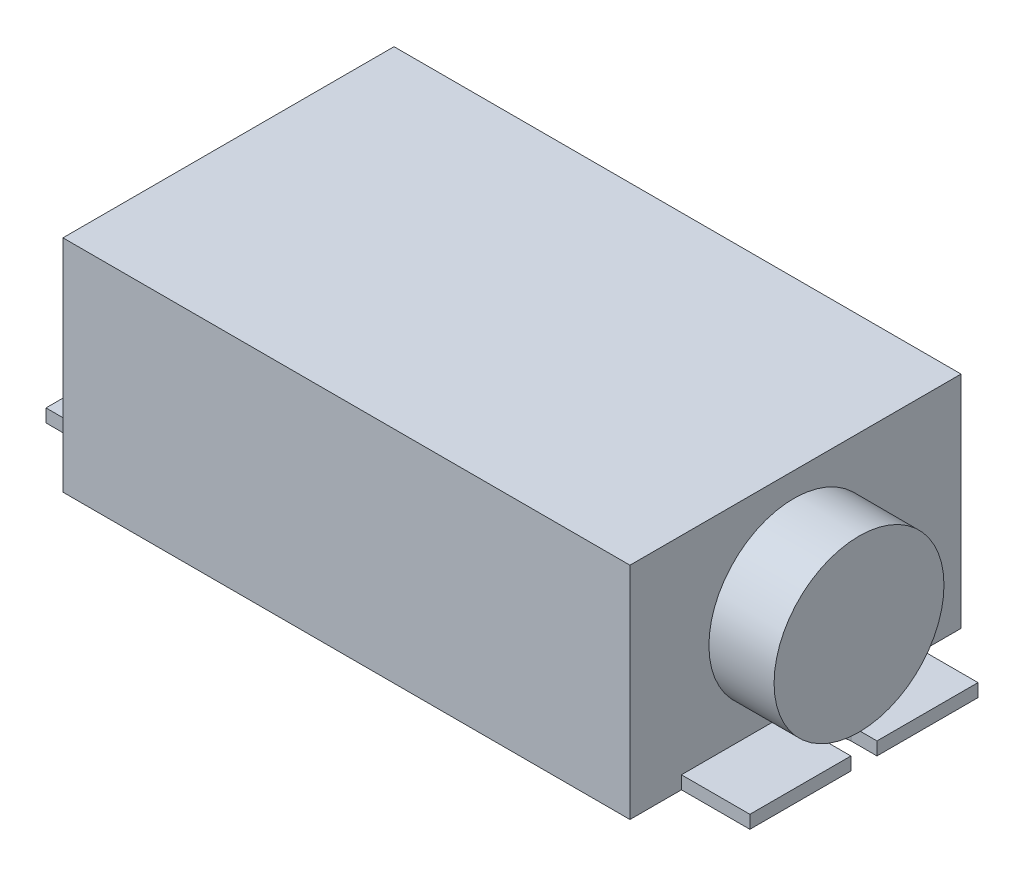
ISO-10303-21;
HEADER;
FILE_DESCRIPTION(('STEP AP214'),'2;1');
FILE_NAME('part.step','',(''),(''),'','','');
FILE_SCHEMA(('AUTOMOTIVE_DESIGN { 1 0 10303 214 1 1 1 1 }'));
ENDSEC;
DATA;
#1=APPLICATION_CONTEXT('core data for automotive mechanical design processes');
#2=APPLICATION_PROTOCOL_DEFINITION('international standard','automotive_design',2000,#1);
#3=PRODUCT_CONTEXT('',#1,'mechanical');
#4=PRODUCT('Part','Part','',(#3));
#5=PRODUCT_RELATED_PRODUCT_CATEGORY('part','',(#4));
#6=PRODUCT_DEFINITION_FORMATION('','',#4);
#7=PRODUCT_DEFINITION_CONTEXT('part definition',#1,'design');
#8=PRODUCT_DEFINITION('design','',#6,#7);
#9=PRODUCT_DEFINITION_SHAPE('','',#8);
#10=(LENGTH_UNIT() NAMED_UNIT(*) SI_UNIT(.MILLI.,.METRE.));
#11=(NAMED_UNIT(*) PLANE_ANGLE_UNIT() SI_UNIT($,.RADIAN.));
#12=(NAMED_UNIT(*) SI_UNIT($,.STERADIAN.) SOLID_ANGLE_UNIT());
#13=UNCERTAINTY_MEASURE_WITH_UNIT(LENGTH_MEASURE(1.E-05),#10,'distance_accuracy_value','');
#14=(GEOMETRIC_REPRESENTATION_CONTEXT(3) GLOBAL_UNCERTAINTY_ASSIGNED_CONTEXT((#13)) GLOBAL_UNIT_ASSIGNED_CONTEXT((#10,
#11,#12)) REPRESENTATION_CONTEXT('',''));
#15=CARTESIAN_POINT('',(0.,0.,0.));
#16=DIRECTION('',(0.,0.,1.));
#17=DIRECTION('',(1.,0.,0.));
#18=AXIS2_PLACEMENT_3D('',#15,#16,#17);
#19=CARTESIAN_POINT('',(0.,33.8,0.));
#20=DIRECTION('',(1.,0.,0.));
#21=DIRECTION('',(0.,0.,-1.));
#22=AXIS2_PLACEMENT_3D('',#19,#20,#21);
#23=PLANE('',#22);
#24=DIRECTION('',(0.,-1.,0.));
#25=VECTOR('',#24,1.);
#26=CARTESIAN_POINT('',(0.,2.,-42.9));
#27=LINE('',#26,#25);
#28=CARTESIAN_POINT('',(0.,2.,-42.9));
#29=VERTEX_POINT('',#28);
#30=CARTESIAN_POINT('',(0.,0.,-42.9));
#31=VERTEX_POINT('',#30);
#32=EDGE_CURVE('E195',#29,#31,#27,.T.);
#33=ORIENTED_EDGE('',*,*,#32,.F.);
#34=DIRECTION('',(0.,0.,1.));
#35=VECTOR('',#34,1.);
#36=CARTESIAN_POINT('',(0.,2.,-42.9));
#37=LINE('',#36,#35);
#38=CARTESIAN_POINT('',(0.,2.,-7.9));
#39=VERTEX_POINT('',#38);
#40=EDGE_CURVE('E187',#29,#39,#37,.T.);
#41=ORIENTED_EDGE('',*,*,#40,.T.);
#42=DIRECTION('',(0.,-1.,0.));
#43=VECTOR('',#42,1.);
#44=CARTESIAN_POINT('',(0.,2.,-7.9));
#45=LINE('',#44,#43);
#46=CARTESIAN_POINT('',(0.,0.,-7.9));
#47=VERTEX_POINT('',#46);
#48=EDGE_CURVE('E173',#39,#47,#45,.T.);
#49=ORIENTED_EDGE('',*,*,#48,.T.);
#50=DIRECTION('',(0.,0.,1.));
#51=VECTOR('',#50,1.);
#52=CARTESIAN_POINT('',(0.,0.,0.));
#53=LINE('',#52,#51);
#54=CARTESIAN_POINT('',(0.,0.,0.));
#55=VERTEX_POINT('',#54);
#56=EDGE_CURVE('E235',#47,#55,#53,.T.);
#57=ORIENTED_EDGE('',*,*,#56,.T.);
#58=DIRECTION('',(0.,-1.,0.));
#59=VECTOR('',#58,1.);
#60=CARTESIAN_POINT('',(0.,33.8,0.));
#61=LINE('',#60,#59);
#62=CARTESIAN_POINT('',(0.,33.8,0.));
#63=VERTEX_POINT('',#62);
#64=EDGE_CURVE('E46',#63,#55,#61,.T.);
#65=ORIENTED_EDGE('',*,*,#64,.F.);
#66=DIRECTION('',(0.,0.,1.));
#67=VECTOR('',#66,1.);
#68=CARTESIAN_POINT('',(0.,33.8,0.));
#69=LINE('',#68,#67);
#70=CARTESIAN_POINT('',(0.,33.8,-50.8));
#71=VERTEX_POINT('',#70);
#72=EDGE_CURVE('E305',#71,#63,#69,.T.);
#73=ORIENTED_EDGE('',*,*,#72,.F.);
#74=DIRECTION('',(0.,-1.,0.));
#75=VECTOR('',#74,1.);
#76=CARTESIAN_POINT('',(0.,33.8,-50.8));
#77=LINE('',#76,#75);
#78=CARTESIAN_POINT('',(0.,0.,-50.8));
#79=VERTEX_POINT('',#78);
#80=EDGE_CURVE('E315',#71,#79,#77,.T.);
#81=ORIENTED_EDGE('',*,*,#80,.T.);
#82=EDGE_CURVE('E316',#79,#31,#53,.T.);
#83=ORIENTED_EDGE('',*,*,#82,.T.);
#84=EDGE_LOOP('',(#33,#41,#49,#57,#65,#73,#81,#83));
#85=FACE_BOUND('',#84,.T.);
#86=ADVANCED_FACE('F39',(#85),#23,.F.);
#87=CARTESIAN_POINT('',(87.,33.8,0.));
#88=DIRECTION('',(-1.,0.,0.));
#89=DIRECTION('',(0.,0.,1.));
#90=AXIS2_PLACEMENT_3D('',#87,#88,#89);
#91=PLANE('',#90);
#92=CARTESIAN_POINT('',(87.,17.068762313408,-25.1463572331028));
#93=DIRECTION('',(-1.,0.,0.));
#94=DIRECTION('',(0.,0.,1.));
#95=AXIS2_PLACEMENT_3D('',#92,#93,#94);
#96=CIRCLE('',#95,13.0342339037933);
#97=CARTESIAN_POINT('',(87.,17.068762313408,-12.1121233293095));
#98=VERTEX_POINT('',#97);
#99=EDGE_CURVE('E11',#98,#98,#96,.F.);
#100=ORIENTED_EDGE('',*,*,#99,.F.);
#101=EDGE_LOOP('',(#100));
#102=FACE_BOUND('',#101,.T.);
#103=DIRECTION('',(0.,-1.,0.));
#104=VECTOR('',#103,1.);
#105=CARTESIAN_POINT('',(87.,2.,-7.90000000000005));
#106=LINE('',#105,#104);
#107=CARTESIAN_POINT('',(87.,2.,-7.90000000000005));
#108=VERTEX_POINT('',#107);
#109=CARTESIAN_POINT('',(87.,0.,-7.90000000000005));
#110=VERTEX_POINT('',#109);
#111=EDGE_CURVE('E254',#108,#110,#106,.T.);
#112=ORIENTED_EDGE('',*,*,#111,.F.);
#113=DIRECTION('',(0.,0.,-1.));
#114=VECTOR('',#113,1.);
#115=CARTESIAN_POINT('',(87.,2.,-42.9));
#116=LINE('',#115,#114);
#117=CARTESIAN_POINT('',(87.,2.,-42.9));
#118=VERTEX_POINT('',#117);
#119=EDGE_CURVE('E291',#108,#118,#116,.T.);
#120=ORIENTED_EDGE('',*,*,#119,.T.);
#121=DIRECTION('',(0.,-1.,0.));
#122=VECTOR('',#121,1.);
#123=CARTESIAN_POINT('',(87.,2.,-42.9));
#124=LINE('',#123,#122);
#125=CARTESIAN_POINT('',(87.,0.,-42.9));
#126=VERTEX_POINT('',#125);
#127=EDGE_CURVE('E256',#118,#126,#124,.T.);
#128=ORIENTED_EDGE('',*,*,#127,.T.);
#129=DIRECTION('',(0.,0.,-1.));
#130=VECTOR('',#129,1.);
#131=CARTESIAN_POINT('',(87.,0.,0.));
#132=LINE('',#131,#130);
#133=CARTESIAN_POINT('',(87.,0.,-50.8));
#134=VERTEX_POINT('',#133);
#135=EDGE_CURVE('E320',#126,#134,#132,.T.);
#136=ORIENTED_EDGE('',*,*,#135,.T.);
#137=DIRECTION('',(0.,-1.,0.));
#138=VECTOR('',#137,1.);
#139=CARTESIAN_POINT('',(87.,33.8,-50.8));
#140=LINE('',#139,#138);
#141=CARTESIAN_POINT('',(87.,33.8,-50.8));
#142=VERTEX_POINT('',#141);
#143=EDGE_CURVE('E327',#142,#134,#140,.T.);
#144=ORIENTED_EDGE('',*,*,#143,.F.);
#145=DIRECTION('',(0.,0.,-1.));
#146=VECTOR('',#145,1.);
#147=CARTESIAN_POINT('',(87.,33.8,0.));
#148=LINE('',#147,#146);
#149=CARTESIAN_POINT('',(87.,33.8,0.));
#150=VERTEX_POINT('',#149);
#151=EDGE_CURVE('E311',#150,#142,#148,.T.);
#152=ORIENTED_EDGE('',*,*,#151,.F.);
#153=DIRECTION('',(0.,-1.,0.));
#154=VECTOR('',#153,1.);
#155=CARTESIAN_POINT('',(87.,33.8,0.));
#156=LINE('',#155,#154);
#157=CARTESIAN_POINT('',(87.,0.,0.));
#158=VERTEX_POINT('',#157);
#159=EDGE_CURVE('E330',#150,#158,#156,.T.);
#160=ORIENTED_EDGE('',*,*,#159,.T.);
#161=EDGE_CURVE('E321',#158,#110,#132,.T.);
#162=ORIENTED_EDGE('',*,*,#161,.T.);
#163=EDGE_LOOP('',(#112,#120,#128,#136,#144,#152,#160,#162));
#164=FACE_BOUND('',#163,.T.);
#165=ADVANCED_FACE('F346',(#102,#164),#91,.F.);
#166=CARTESIAN_POINT('',(0.,33.8,0.));
#167=DIRECTION('',(0.,0.,-1.));
#168=DIRECTION('',(-1.,0.,0.));
#169=AXIS2_PLACEMENT_3D('',#166,#167,#168);
#170=PLANE('',#169);
#171=DIRECTION('',(1.,0.,0.));
#172=VECTOR('',#171,1.);
#173=CARTESIAN_POINT('',(0.,0.,0.));
#174=LINE('',#173,#172);
#175=EDGE_CURVE('E318',#55,#158,#174,.T.);
#176=ORIENTED_EDGE('',*,*,#175,.T.);
#177=ORIENTED_EDGE('',*,*,#159,.F.);
#178=DIRECTION('',(1.,0.,0.));
#179=VECTOR('',#178,1.);
#180=CARTESIAN_POINT('',(0.,33.8,0.));
#181=LINE('',#180,#179);
#182=EDGE_CURVE('E308',#63,#150,#181,.T.);
#183=ORIENTED_EDGE('',*,*,#182,.F.);
#184=ORIENTED_EDGE('',*,*,#64,.T.);
#185=EDGE_LOOP('',(#176,#177,#183,#184));
#186=FACE_BOUND('',#185,.T.);
#187=ADVANCED_FACE('F335',(#186),#170,.F.);
#188=CARTESIAN_POINT('',(0.,33.8,-50.8));
#189=DIRECTION('',(0.,0.,1.));
#190=DIRECTION('',(1.,0.,0.));
#191=AXIS2_PLACEMENT_3D('',#188,#189,#190);
#192=PLANE('',#191);
#193=DIRECTION('',(-1.,0.,0.));
#194=VECTOR('',#193,1.);
#195=CARTESIAN_POINT('',(0.,0.,-50.8));
#196=LINE('',#195,#194);
#197=EDGE_CURVE('E309',#134,#79,#196,.T.);
#198=ORIENTED_EDGE('',*,*,#197,.T.);
#199=ORIENTED_EDGE('',*,*,#80,.F.);
#200=DIRECTION('',(-1.,0.,0.));
#201=VECTOR('',#200,1.);
#202=CARTESIAN_POINT('',(0.,33.8,-50.8));
#203=LINE('',#202,#201);
#204=EDGE_CURVE('E313',#142,#71,#203,.T.);
#205=ORIENTED_EDGE('',*,*,#204,.F.);
#206=ORIENTED_EDGE('',*,*,#143,.T.);
#207=EDGE_LOOP('',(#198,#199,#205,#206));
#208=FACE_BOUND('',#207,.T.);
#209=ADVANCED_FACE('F354',(#208),#192,.F.);
#210=CARTESIAN_POINT('',(0.,33.8,0.));
#211=DIRECTION('',(0.,-1.,0.));
#212=DIRECTION('',(0.,0.,-1.));
#213=AXIS2_PLACEMENT_3D('',#210,#211,#212);
#214=PLANE('',#213);
#215=ORIENTED_EDGE('',*,*,#72,.T.);
#216=ORIENTED_EDGE('',*,*,#182,.T.);
#217=ORIENTED_EDGE('',*,*,#151,.T.);
#218=ORIENTED_EDGE('',*,*,#204,.T.);
#219=EDGE_LOOP('',(#215,#216,#217,#218));
#220=FACE_BOUND('',#219,.T.);
#221=ADVANCED_FACE('F351',(#220),#214,.F.);
#222=CARTESIAN_POINT('',(0.,0.,0.));
#223=DIRECTION('',(0.,-1.,0.));
#224=DIRECTION('',(0.,0.,-1.));
#225=AXIS2_PLACEMENT_3D('',#222,#223,#224);
#226=PLANE('',#225);
#227=ORIENTED_EDGE('',*,*,#82,.F.);
#228=ORIENTED_EDGE('',*,*,#197,.F.);
#229=ORIENTED_EDGE('',*,*,#135,.F.);
#230=DIRECTION('',(1.,0.,0.));
#231=VECTOR('',#230,1.);
#232=CARTESIAN_POINT('',(87.,0.,-42.9));
#233=LINE('',#232,#231);
#234=CARTESIAN_POINT('',(97.5,0.,-42.9));
#235=VERTEX_POINT('',#234);
#236=EDGE_CURVE('E61',#126,#235,#233,.T.);
#237=ORIENTED_EDGE('',*,*,#236,.T.);
#238=DIRECTION('',(0.,0.,1.));
#239=VECTOR('',#238,1.);
#240=CARTESIAN_POINT('',(97.5,0.,-42.9));
#241=LINE('',#240,#239);
#242=CARTESIAN_POINT('',(97.5,0.,-27.4));
#243=VERTEX_POINT('',#242);
#244=EDGE_CURVE('E267',#235,#243,#241,.T.);
#245=ORIENTED_EDGE('',*,*,#244,.T.);
#246=DIRECTION('',(-1.,0.,0.));
#247=VECTOR('',#246,1.);
#248=CARTESIAN_POINT('',(97.5,0.,-27.4));
#249=LINE('',#248,#247);
#250=CARTESIAN_POINT('',(93.5,0.,-27.4));
#251=VERTEX_POINT('',#250);
#252=EDGE_CURVE('E264',#243,#251,#249,.T.);
#253=ORIENTED_EDGE('',*,*,#252,.T.);
#254=CARTESIAN_POINT('',(93.5,0.,-25.4));
#255=DIRECTION('',(0.,1.,0.));
#256=DIRECTION('',(0.,0.,1.));
#257=AXIS2_PLACEMENT_3D('',#254,#255,#256);
#258=CIRCLE('',#257,2.);
#259=CARTESIAN_POINT('',(93.5,0.,-23.4));
#260=VERTEX_POINT('',#259);
#261=EDGE_CURVE('E220',#251,#260,#258,.T.);
#262=ORIENTED_EDGE('',*,*,#261,.T.);
#263=DIRECTION('',(1.,0.,0.));
#264=VECTOR('',#263,1.);
#265=CARTESIAN_POINT('',(93.5,0.,-23.4));
#266=LINE('',#265,#264);
#267=CARTESIAN_POINT('',(97.5,0.,-23.4));
#268=VERTEX_POINT('',#267);
#269=EDGE_CURVE('E278',#260,#268,#266,.T.);
#270=ORIENTED_EDGE('',*,*,#269,.T.);
#271=DIRECTION('',(0.,0.,1.));
#272=VECTOR('',#271,1.);
#273=CARTESIAN_POINT('',(97.5,0.,-23.4));
#274=LINE('',#273,#272);
#275=CARTESIAN_POINT('',(97.5,0.,-7.9));
#276=VERTEX_POINT('',#275);
#277=EDGE_CURVE('E275',#268,#276,#274,.T.);
#278=ORIENTED_EDGE('',*,*,#277,.T.);
#279=DIRECTION('',(-1.,0.,0.));
#280=VECTOR('',#279,1.);
#281=CARTESIAN_POINT('',(87.,0.,-7.90000000000005));
#282=LINE('',#281,#280);
#283=EDGE_CURVE('E272',#276,#110,#282,.T.);
#284=ORIENTED_EDGE('',*,*,#283,.T.);
#285=ORIENTED_EDGE('',*,*,#161,.F.);
#286=ORIENTED_EDGE('',*,*,#175,.F.);
#287=ORIENTED_EDGE('',*,*,#56,.F.);
#288=DIRECTION('',(-1.,0.,0.));
#289=VECTOR('',#288,1.);
#290=CARTESIAN_POINT('',(0.,0.,-7.9));
#291=LINE('',#290,#289);
#292=CARTESIAN_POINT('',(-10.5,0.,-7.9));
#293=VERTEX_POINT('',#292);
#294=EDGE_CURVE('E53',#47,#293,#291,.T.);
#295=ORIENTED_EDGE('',*,*,#294,.T.);
#296=DIRECTION('',(0.,0.,-1.));
#297=VECTOR('',#296,1.);
#298=CARTESIAN_POINT('',(-10.5,0.,-23.4));
#299=LINE('',#298,#297);
#300=CARTESIAN_POINT('',(-10.5,0.,-23.4));
#301=VERTEX_POINT('',#300);
#302=EDGE_CURVE('E219',#293,#301,#299,.T.);
#303=ORIENTED_EDGE('',*,*,#302,.T.);
#304=DIRECTION('',(1.,0.,0.));
#305=VECTOR('',#304,1.);
#306=CARTESIAN_POINT('',(-6.5,0.,-23.4));
#307=LINE('',#306,#305);
#308=CARTESIAN_POINT('',(-6.5,0.,-23.4));
#309=VERTEX_POINT('',#308);
#310=EDGE_CURVE('E223',#301,#309,#307,.T.);
#311=ORIENTED_EDGE('',*,*,#310,.T.);
#312=CARTESIAN_POINT('',(-6.5,0.,-25.4));
#313=DIRECTION('',(0.,1.,0.));
#314=DIRECTION('',(0.,0.,-1.));
#315=AXIS2_PLACEMENT_3D('',#312,#313,#314);
#316=CIRCLE('',#315,2.);
#317=CARTESIAN_POINT('',(-6.5,0.,-27.4));
#318=VERTEX_POINT('',#317);
#319=EDGE_CURVE('E226',#309,#318,#316,.T.);
#320=ORIENTED_EDGE('',*,*,#319,.T.);
#321=DIRECTION('',(-1.,0.,0.));
#322=VECTOR('',#321,1.);
#323=CARTESIAN_POINT('',(-10.5,0.,-27.4));
#324=LINE('',#323,#322);
#325=CARTESIAN_POINT('',(-10.5,0.,-27.4));
#326=VERTEX_POINT('',#325);
#327=EDGE_CURVE('E229',#318,#326,#324,.T.);
#328=ORIENTED_EDGE('',*,*,#327,.T.);
#329=DIRECTION('',(0.,0.,-1.));
#330=VECTOR('',#329,1.);
#331=CARTESIAN_POINT('',(-10.5,0.,-42.9));
#332=LINE('',#331,#330);
#333=CARTESIAN_POINT('',(-10.5,0.,-42.9));
#334=VERTEX_POINT('',#333);
#335=EDGE_CURVE('E199',#326,#334,#332,.T.);
#336=ORIENTED_EDGE('',*,*,#335,.T.);
#337=DIRECTION('',(1.,0.,0.));
#338=VECTOR('',#337,1.);
#339=CARTESIAN_POINT('',(0.,0.,-42.9));
#340=LINE('',#339,#338);
#341=EDGE_CURVE('E196',#334,#31,#340,.T.);
#342=ORIENTED_EDGE('',*,*,#341,.T.);
#343=EDGE_LOOP('',(#227,#228,#229,#237,#245,#253,#262,#270,#278,#284,#285,#286,#287,#295,#303,
#311,#320,#328,#336,#342));
#344=FACE_BOUND('',#343,.T.);
#345=ADVANCED_FACE('F342',(#344),#226,.T.);
#346=CARTESIAN_POINT('',(93.5,2.,-25.4));
#347=DIRECTION('',(0.,-1.,0.));
#348=DIRECTION('',(0.,0.,-1.));
#349=AXIS2_PLACEMENT_3D('',#346,#347,#348);
#350=CYLINDRICAL_SURFACE('',#349,2.);
#351=ORIENTED_EDGE('',*,*,#261,.F.);
#352=DIRECTION('',(0.,-1.,0.));
#353=VECTOR('',#352,1.);
#354=CARTESIAN_POINT('',(93.5,2.,-27.4));
#355=LINE('',#354,#353);
#356=CARTESIAN_POINT('',(93.5,2.,-27.4));
#357=VERTEX_POINT('',#356);
#358=EDGE_CURVE('E262',#357,#251,#355,.T.);
#359=ORIENTED_EDGE('',*,*,#358,.F.);
#360=CARTESIAN_POINT('',(93.5,2.,-25.4));
#361=DIRECTION('',(0.,1.,0.));
#362=DIRECTION('',(0.,0.,1.));
#363=AXIS2_PLACEMENT_3D('',#360,#361,#362);
#364=CIRCLE('',#363,2.);
#365=CARTESIAN_POINT('',(93.5,2.,-23.4));
#366=VERTEX_POINT('',#365);
#367=EDGE_CURVE('E268',#357,#366,#364,.T.);
#368=ORIENTED_EDGE('',*,*,#367,.T.);
#369=DIRECTION('',(0.,-1.,0.));
#370=VECTOR('',#369,1.);
#371=CARTESIAN_POINT('',(93.5,2.,-23.4));
#372=LINE('',#371,#370);
#373=EDGE_CURVE('E247',#366,#260,#372,.T.);
#374=ORIENTED_EDGE('',*,*,#373,.T.);
#375=EDGE_LOOP('',(#351,#359,#368,#374));
#376=FACE_BOUND('',#375,.T.);
#377=ADVANCED_FACE('F403',(#376),#350,.F.);
#378=CARTESIAN_POINT('',(97.5,2.,-27.4));
#379=DIRECTION('',(0.,0.,1.));
#380=DIRECTION('',(1.,0.,0.));
#381=AXIS2_PLACEMENT_3D('',#378,#379,#380);
#382=PLANE('',#381);
#383=ORIENTED_EDGE('',*,*,#252,.F.);
#384=DIRECTION('',(0.,-1.,0.));
#385=VECTOR('',#384,1.);
#386=CARTESIAN_POINT('',(97.5,2.,-27.4));
#387=LINE('',#386,#385);
#388=CARTESIAN_POINT('',(97.5,2.,-27.4));
#389=VERTEX_POINT('',#388);
#390=EDGE_CURVE('E260',#389,#243,#387,.T.);
#391=ORIENTED_EDGE('',*,*,#390,.F.);
#392=DIRECTION('',(-1.,0.,0.));
#393=VECTOR('',#392,1.);
#394=CARTESIAN_POINT('',(97.5,2.,-27.4));
#395=LINE('',#394,#393);
#396=EDGE_CURVE('E249',#389,#357,#395,.T.);
#397=ORIENTED_EDGE('',*,*,#396,.T.);
#398=ORIENTED_EDGE('',*,*,#358,.T.);
#399=EDGE_LOOP('',(#383,#391,#397,#398));
#400=FACE_BOUND('',#399,.T.);
#401=ADVANCED_FACE('F410',(#400),#382,.T.);
#402=CARTESIAN_POINT('',(97.5,2.,-42.9));
#403=DIRECTION('',(1.,0.,0.));
#404=DIRECTION('',(0.,0.,-1.));
#405=AXIS2_PLACEMENT_3D('',#402,#403,#404);
#406=PLANE('',#405);
#407=ORIENTED_EDGE('',*,*,#244,.F.);
#408=DIRECTION('',(0.,-1.,0.));
#409=VECTOR('',#408,1.);
#410=CARTESIAN_POINT('',(97.5,2.,-42.9));
#411=LINE('',#410,#409);
#412=CARTESIAN_POINT('',(97.5,2.,-42.9));
#413=VERTEX_POINT('',#412);
#414=EDGE_CURVE('E258',#413,#235,#411,.T.);
#415=ORIENTED_EDGE('',*,*,#414,.F.);
#416=DIRECTION('',(0.,0.,1.));
#417=VECTOR('',#416,1.);
#418=CARTESIAN_POINT('',(97.5,2.,-42.9));
#419=LINE('',#418,#417);
#420=EDGE_CURVE('E285',#413,#389,#419,.T.);
#421=ORIENTED_EDGE('',*,*,#420,.T.);
#422=ORIENTED_EDGE('',*,*,#390,.T.);
#423=EDGE_LOOP('',(#407,#415,#421,#422));
#424=FACE_BOUND('',#423,.T.);
#425=ADVANCED_FACE('F413',(#424),#406,.T.);
#426=CARTESIAN_POINT('',(87.,2.,-42.9));
#427=DIRECTION('',(0.,0.,-1.));
#428=DIRECTION('',(-1.,0.,0.));
#429=AXIS2_PLACEMENT_3D('',#426,#427,#428);
#430=PLANE('',#429);
#431=ORIENTED_EDGE('',*,*,#236,.F.);
#432=ORIENTED_EDGE('',*,*,#127,.F.);
#433=DIRECTION('',(1.,0.,0.));
#434=VECTOR('',#433,1.);
#435=CARTESIAN_POINT('',(87.,2.,-42.9));
#436=LINE('',#435,#434);
#437=EDGE_CURVE('E288',#118,#413,#436,.T.);
#438=ORIENTED_EDGE('',*,*,#437,.T.);
#439=ORIENTED_EDGE('',*,*,#414,.T.);
#440=EDGE_LOOP('',(#431,#432,#438,#439));
#441=FACE_BOUND('',#440,.T.);
#442=ADVANCED_FACE('F417',(#441),#430,.T.);
#443=CARTESIAN_POINT('',(87.,2.,-7.90000000000005));
#444=DIRECTION('',(0.,0.,1.));
#445=DIRECTION('',(1.,0.,0.));
#446=AXIS2_PLACEMENT_3D('',#443,#444,#445);
#447=PLANE('',#446);
#448=ORIENTED_EDGE('',*,*,#283,.F.);
#449=DIRECTION('',(0.,-1.,0.));
#450=VECTOR('',#449,1.);
#451=CARTESIAN_POINT('',(97.5,2.,-7.9));
#452=LINE('',#451,#450);
#453=CARTESIAN_POINT('',(97.5,2.,-7.9));
#454=VERTEX_POINT('',#453);
#455=EDGE_CURVE('E252',#454,#276,#452,.T.);
#456=ORIENTED_EDGE('',*,*,#455,.F.);
#457=DIRECTION('',(-1.,0.,0.));
#458=VECTOR('',#457,1.);
#459=CARTESIAN_POINT('',(87.,2.,-7.90000000000005));
#460=LINE('',#459,#458);
#461=EDGE_CURVE('E294',#454,#108,#460,.T.);
#462=ORIENTED_EDGE('',*,*,#461,.T.);
#463=ORIENTED_EDGE('',*,*,#111,.T.);
#464=EDGE_LOOP('',(#448,#456,#462,#463));
#465=FACE_BOUND('',#464,.T.);
#466=ADVANCED_FACE('F421',(#465),#447,.T.);
#467=CARTESIAN_POINT('',(97.5,2.,-23.4));
#468=DIRECTION('',(1.,0.,0.));
#469=DIRECTION('',(0.,0.,-1.));
#470=AXIS2_PLACEMENT_3D('',#467,#468,#469);
#471=PLANE('',#470);
#472=ORIENTED_EDGE('',*,*,#277,.F.);
#473=DIRECTION('',(0.,-1.,0.));
#474=VECTOR('',#473,1.);
#475=CARTESIAN_POINT('',(97.5,2.,-23.4));
#476=LINE('',#475,#474);
#477=CARTESIAN_POINT('',(97.5,2.,-23.4));
#478=VERTEX_POINT('',#477);
#479=EDGE_CURVE('E250',#478,#268,#476,.T.);
#480=ORIENTED_EDGE('',*,*,#479,.F.);
#481=DIRECTION('',(0.,0.,1.));
#482=VECTOR('',#481,1.);
#483=CARTESIAN_POINT('',(97.5,2.,-23.4));
#484=LINE('',#483,#482);
#485=EDGE_CURVE('E297',#478,#454,#484,.T.);
#486=ORIENTED_EDGE('',*,*,#485,.T.);
#487=ORIENTED_EDGE('',*,*,#455,.T.);
#488=EDGE_LOOP('',(#472,#480,#486,#487));
#489=FACE_BOUND('',#488,.T.);
#490=ADVANCED_FACE('F424',(#489),#471,.T.);
#491=CARTESIAN_POINT('',(93.5,2.,-23.4));
#492=DIRECTION('',(0.,0.,-1.));
#493=DIRECTION('',(-1.,0.,0.));
#494=AXIS2_PLACEMENT_3D('',#491,#492,#493);
#495=PLANE('',#494);
#496=ORIENTED_EDGE('',*,*,#269,.F.);
#497=ORIENTED_EDGE('',*,*,#373,.F.);
#498=DIRECTION('',(1.,0.,0.));
#499=VECTOR('',#498,1.);
#500=CARTESIAN_POINT('',(93.5,2.,-23.4));
#501=LINE('',#500,#499);
#502=EDGE_CURVE('E300',#366,#478,#501,.T.);
#503=ORIENTED_EDGE('',*,*,#502,.T.);
#504=ORIENTED_EDGE('',*,*,#479,.T.);
#505=EDGE_LOOP('',(#496,#497,#503,#504));
#506=FACE_BOUND('',#505,.T.);
#507=ADVANCED_FACE('F408',(#506),#495,.T.);
#508=CARTESIAN_POINT('',(93.5,2.,-25.4));
#509=DIRECTION('',(0.,1.,0.));
#510=DIRECTION('',(0.,0.,1.));
#511=AXIS2_PLACEMENT_3D('',#508,#509,#510);
#512=PLANE('',#511);
#513=ORIENTED_EDGE('',*,*,#367,.F.);
#514=ORIENTED_EDGE('',*,*,#396,.F.);
#515=ORIENTED_EDGE('',*,*,#420,.F.);
#516=ORIENTED_EDGE('',*,*,#437,.F.);
#517=ORIENTED_EDGE('',*,*,#119,.F.);
#518=ORIENTED_EDGE('',*,*,#461,.F.);
#519=ORIENTED_EDGE('',*,*,#485,.F.);
#520=ORIENTED_EDGE('',*,*,#502,.F.);
#521=EDGE_LOOP('',(#513,#514,#515,#516,#517,#518,#519,#520));
#522=FACE_BOUND('',#521,.T.);
#523=ADVANCED_FACE('F405',(#522),#512,.T.);
#524=CARTESIAN_POINT('',(0.,2.,-42.9));
#525=DIRECTION('',(0.,0.,-1.));
#526=DIRECTION('',(-1.,0.,0.));
#527=AXIS2_PLACEMENT_3D('',#524,#525,#526);
#528=PLANE('',#527);
#529=ORIENTED_EDGE('',*,*,#341,.F.);
#530=DIRECTION('',(0.,-1.,0.));
#531=VECTOR('',#530,1.);
#532=CARTESIAN_POINT('',(-10.5,2.,-42.9));
#533=LINE('',#532,#531);
#534=CARTESIAN_POINT('',(-10.5,2.,-42.9));
#535=VERTEX_POINT('',#534);
#536=EDGE_CURVE('E236',#535,#334,#533,.T.);
#537=ORIENTED_EDGE('',*,*,#536,.F.);
#538=DIRECTION('',(1.,0.,0.));
#539=VECTOR('',#538,1.);
#540=CARTESIAN_POINT('',(0.,2.,-42.9));
#541=LINE('',#540,#539);
#542=EDGE_CURVE('E181',#535,#29,#541,.T.);
#543=ORIENTED_EDGE('',*,*,#542,.T.);
#544=ORIENTED_EDGE('',*,*,#32,.T.);
#545=EDGE_LOOP('',(#529,#537,#543,#544));
#546=FACE_BOUND('',#545,.T.);
#547=ADVANCED_FACE('F360',(#546),#528,.T.);
#548=CARTESIAN_POINT('',(-10.5,2.,-42.9));
#549=DIRECTION('',(-1.,0.,0.));
#550=DIRECTION('',(0.,0.,1.));
#551=AXIS2_PLACEMENT_3D('',#548,#549,#550);
#552=PLANE('',#551);
#553=ORIENTED_EDGE('',*,*,#335,.F.);
#554=DIRECTION('',(0.,-1.,0.));
#555=VECTOR('',#554,1.);
#556=CARTESIAN_POINT('',(-10.5,2.,-27.4));
#557=LINE('',#556,#555);
#558=CARTESIAN_POINT('',(-10.5,2.,-27.4));
#559=VERTEX_POINT('',#558);
#560=EDGE_CURVE('E238',#559,#326,#557,.T.);
#561=ORIENTED_EDGE('',*,*,#560,.F.);
#562=DIRECTION('',(0.,0.,-1.));
#563=VECTOR('',#562,1.);
#564=CARTESIAN_POINT('',(-10.5,2.,-42.9));
#565=LINE('',#564,#563);
#566=EDGE_CURVE('E214',#559,#535,#565,.T.);
#567=ORIENTED_EDGE('',*,*,#566,.T.);
#568=ORIENTED_EDGE('',*,*,#536,.T.);
#569=EDGE_LOOP('',(#553,#561,#567,#568));
#570=FACE_BOUND('',#569,.T.);
#571=ADVANCED_FACE('F492',(#570),#552,.T.);
#572=CARTESIAN_POINT('',(-10.5,2.,-27.4));
#573=DIRECTION('',(0.,0.,1.));
#574=DIRECTION('',(1.,0.,0.));
#575=AXIS2_PLACEMENT_3D('',#572,#573,#574);
#576=PLANE('',#575);
#577=ORIENTED_EDGE('',*,*,#327,.F.);
#578=DIRECTION('',(0.,-1.,0.));
#579=VECTOR('',#578,1.);
#580=CARTESIAN_POINT('',(-6.5,2.,-27.4));
#581=LINE('',#580,#579);
#582=CARTESIAN_POINT('',(-6.5,2.,-27.4));
#583=VERTEX_POINT('',#582);
#584=EDGE_CURVE('E240',#583,#318,#581,.T.);
#585=ORIENTED_EDGE('',*,*,#584,.F.);
#586=DIRECTION('',(-1.,0.,0.));
#587=VECTOR('',#586,1.);
#588=CARTESIAN_POINT('',(-10.5,2.,-27.4));
#589=LINE('',#588,#587);
#590=EDGE_CURVE('E211',#583,#559,#589,.T.);
#591=ORIENTED_EDGE('',*,*,#590,.T.);
#592=ORIENTED_EDGE('',*,*,#560,.T.);
#593=EDGE_LOOP('',(#577,#585,#591,#592));
#594=FACE_BOUND('',#593,.T.);
#595=ADVANCED_FACE('F367',(#594),#576,.T.);
#596=CARTESIAN_POINT('',(-6.5,2.,-25.4));
#597=DIRECTION('',(0.,-1.,0.));
#598=DIRECTION('',(0.,0.,-1.));
#599=AXIS2_PLACEMENT_3D('',#596,#597,#598);
#600=CYLINDRICAL_SURFACE('',#599,2.);
#601=ORIENTED_EDGE('',*,*,#319,.F.);
#602=DIRECTION('',(0.,-1.,0.));
#603=VECTOR('',#602,1.);
#604=CARTESIAN_POINT('',(-6.5,2.,-23.4));
#605=LINE('',#604,#603);
#606=CARTESIAN_POINT('',(-6.5,2.,-23.4));
#607=VERTEX_POINT('',#606);
#608=EDGE_CURVE('E242',#607,#309,#605,.T.);
#609=ORIENTED_EDGE('',*,*,#608,.F.);
#610=CARTESIAN_POINT('',(-6.5,2.,-25.4));
#611=DIRECTION('',(0.,1.,0.));
#612=DIRECTION('',(0.,0.,-1.));
#613=AXIS2_PLACEMENT_3D('',#610,#611,#612);
#614=CIRCLE('',#613,2.);
#615=EDGE_CURVE('E208',#607,#583,#614,.T.);
#616=ORIENTED_EDGE('',*,*,#615,.T.);
#617=ORIENTED_EDGE('',*,*,#584,.T.);
#618=EDGE_LOOP('',(#601,#609,#616,#617));
#619=FACE_BOUND('',#618,.T.);
#620=ADVANCED_FACE('F370',(#619),#600,.F.);
#621=CARTESIAN_POINT('',(-6.5,2.,-23.4));
#622=DIRECTION('',(0.,0.,-1.));
#623=DIRECTION('',(-1.,0.,0.));
#624=AXIS2_PLACEMENT_3D('',#621,#622,#623);
#625=PLANE('',#624);
#626=ORIENTED_EDGE('',*,*,#310,.F.);
#627=DIRECTION('',(0.,-1.,0.));
#628=VECTOR('',#627,1.);
#629=CARTESIAN_POINT('',(-10.5,2.,-23.4));
#630=LINE('',#629,#628);
#631=CARTESIAN_POINT('',(-10.5,2.,-23.4));
#632=VERTEX_POINT('',#631);
#633=EDGE_CURVE('E244',#632,#301,#630,.T.);
#634=ORIENTED_EDGE('',*,*,#633,.F.);
#635=DIRECTION('',(1.,0.,0.));
#636=VECTOR('',#635,1.);
#637=CARTESIAN_POINT('',(-6.5,2.,-23.4));
#638=LINE('',#637,#636);
#639=EDGE_CURVE('E205',#632,#607,#638,.T.);
#640=ORIENTED_EDGE('',*,*,#639,.T.);
#641=ORIENTED_EDGE('',*,*,#608,.T.);
#642=EDGE_LOOP('',(#626,#634,#640,#641));
#643=FACE_BOUND('',#642,.T.);
#644=ADVANCED_FACE('F373',(#643),#625,.T.);
#645=CARTESIAN_POINT('',(-10.5,2.,-23.4));
#646=DIRECTION('',(-1.,0.,0.));
#647=DIRECTION('',(0.,0.,1.));
#648=AXIS2_PLACEMENT_3D('',#645,#646,#647);
#649=PLANE('',#648);
#650=ORIENTED_EDGE('',*,*,#302,.F.);
#651=DIRECTION('',(0.,-1.,0.));
#652=VECTOR('',#651,1.);
#653=CARTESIAN_POINT('',(-10.5,2.,-7.9));
#654=LINE('',#653,#652);
#655=CARTESIAN_POINT('',(-10.5,2.,-7.9));
#656=VERTEX_POINT('',#655);
#657=EDGE_CURVE('E180',#656,#293,#654,.T.);
#658=ORIENTED_EDGE('',*,*,#657,.F.);
#659=DIRECTION('',(0.,0.,-1.));
#660=VECTOR('',#659,1.);
#661=CARTESIAN_POINT('',(-10.5,2.,-23.4));
#662=LINE('',#661,#660);
#663=EDGE_CURVE('E191',#656,#632,#662,.T.);
#664=ORIENTED_EDGE('',*,*,#663,.T.);
#665=ORIENTED_EDGE('',*,*,#633,.T.);
#666=EDGE_LOOP('',(#650,#658,#664,#665));
#667=FACE_BOUND('',#666,.T.);
#668=ADVANCED_FACE('F376',(#667),#649,.T.);
#669=CARTESIAN_POINT('',(0.,2.,-7.9));
#670=DIRECTION('',(0.,0.,1.));
#671=DIRECTION('',(1.,0.,0.));
#672=AXIS2_PLACEMENT_3D('',#669,#670,#671);
#673=PLANE('',#672);
#674=ORIENTED_EDGE('',*,*,#294,.F.);
#675=ORIENTED_EDGE('',*,*,#48,.F.);
#676=DIRECTION('',(-1.,0.,0.));
#677=VECTOR('',#676,1.);
#678=CARTESIAN_POINT('',(0.,2.,-7.9));
#679=LINE('',#678,#677);
#680=EDGE_CURVE('E176',#39,#656,#679,.T.);
#681=ORIENTED_EDGE('',*,*,#680,.T.);
#682=ORIENTED_EDGE('',*,*,#657,.T.);
#683=EDGE_LOOP('',(#674,#675,#681,#682));
#684=FACE_BOUND('',#683,.T.);
#685=ADVANCED_FACE('F175',(#684),#673,.T.);
#686=CARTESIAN_POINT('',(-6.5,2.,-25.4));
#687=DIRECTION('',(0.,-1.,0.));
#688=DIRECTION('',(0.,0.,-1.));
#689=AXIS2_PLACEMENT_3D('',#686,#687,#688);
#690=PLANE('',#689);
#691=ORIENTED_EDGE('',*,*,#40,.F.);
#692=ORIENTED_EDGE('',*,*,#542,.F.);
#693=ORIENTED_EDGE('',*,*,#566,.F.);
#694=ORIENTED_EDGE('',*,*,#590,.F.);
#695=ORIENTED_EDGE('',*,*,#615,.F.);
#696=ORIENTED_EDGE('',*,*,#639,.F.);
#697=ORIENTED_EDGE('',*,*,#663,.F.);
#698=ORIENTED_EDGE('',*,*,#680,.F.);
#699=EDGE_LOOP('',(#691,#692,#693,#694,#695,#696,#697,#698));
#700=FACE_BOUND('',#699,.T.);
#701=ADVANCED_FACE('F185',(#700),#690,.F.);
#702=CARTESIAN_POINT('',(97.,17.068762313408,-25.1463572331028));
#703=DIRECTION('',(-1.,0.,0.));
#704=DIRECTION('',(0.,0.,1.));
#705=AXIS2_PLACEMENT_3D('',#702,#703,#704);
#706=CYLINDRICAL_SURFACE('',#705,13.0342339037933);
#707=CARTESIAN_POINT('',(97.,17.068762313408,-25.1463572331028));
#708=DIRECTION('',(1.,0.,0.));
#709=DIRECTION('',(0.,0.,-1.));
#710=AXIS2_PLACEMENT_3D('',#707,#708,#709);
#711=CIRCLE('',#710,13.0342339037933);
#712=CARTESIAN_POINT('',(97.,17.068762313408,-38.1805911368962));
#713=VERTEX_POINT('',#712);
#714=EDGE_CURVE('E202',#713,#713,#711,.T.);
#715=ORIENTED_EDGE('',*,*,#714,.F.);
#716=EDGE_LOOP('',(#715));
#717=FACE_BOUND('',#716,.T.);
#718=ORIENTED_EDGE('',*,*,#99,.T.);
#719=EDGE_LOOP('',(#718));
#720=FACE_BOUND('',#719,.T.);
#721=ADVANCED_FACE('F538',(#717,#720),#706,.T.);
#722=CARTESIAN_POINT('',(97.,17.068762313408,-25.1463572331028));
#723=DIRECTION('',(1.,0.,0.));
#724=DIRECTION('',(0.,0.,-1.));
#725=AXIS2_PLACEMENT_3D('',#722,#723,#724);
#726=PLANE('',#725);
#727=ORIENTED_EDGE('',*,*,#714,.T.);
#728=EDGE_LOOP('',(#727));
#729=FACE_BOUND('',#728,.T.);
#730=ADVANCED_FACE('F549',(#729),#726,.T.);
#731=CLOSED_SHELL('',(#86,#165,#187,#209,#221,#345,#377,#401,#425,#442,#466,#490,#507,#523,#547,
#571,#595,#620,#644,#668,#685,#701,#721,#730));
#732=MANIFOLD_SOLID_BREP('B2',#731);
#733=ADVANCED_BREP_SHAPE_REPRESENTATION('',(#18,#732),#14);
#734=SHAPE_DEFINITION_REPRESENTATION(#9,#733);
ENDSEC;
END-ISO-10303-21;
